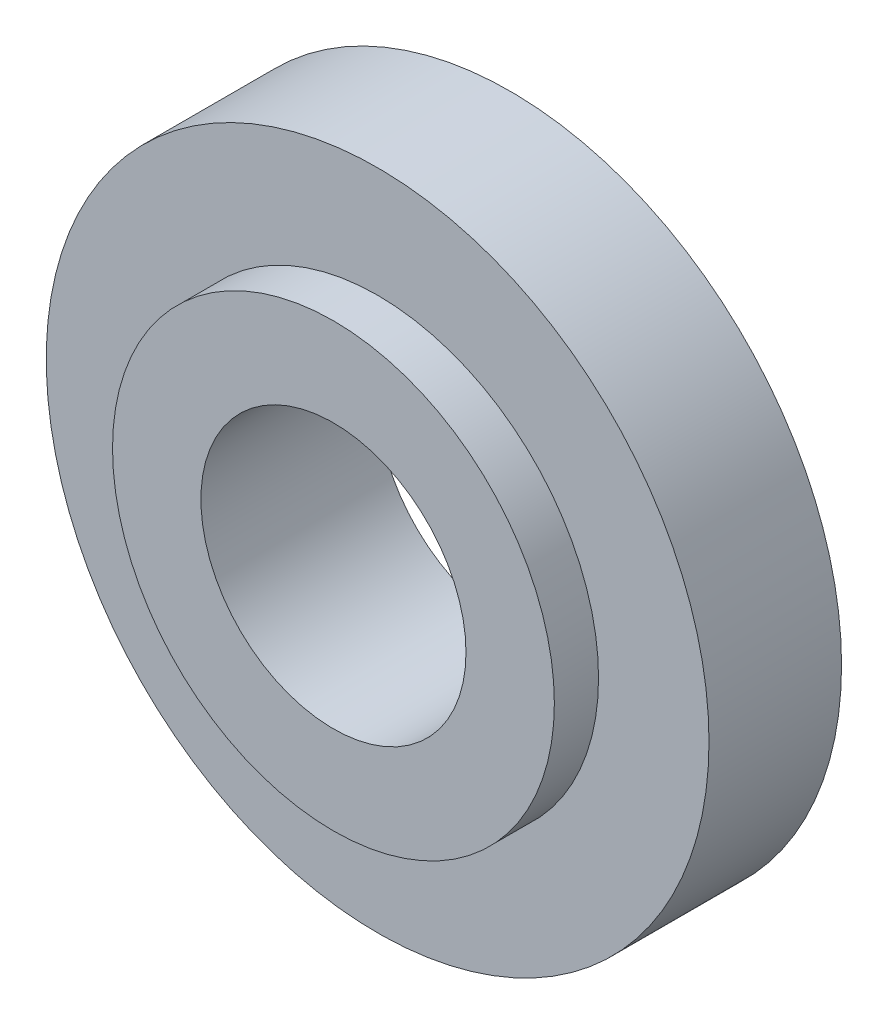
ISO-10303-21;
HEADER;
FILE_DESCRIPTION(('STEP AP214'),'2;1');
FILE_NAME('part.step','',(''),(''),'','','');
FILE_SCHEMA(('AUTOMOTIVE_DESIGN { 1 0 10303 214 1 1 1 1 }'));
ENDSEC;
DATA;
#1=APPLICATION_CONTEXT('core data for automotive mechanical design processes');
#2=APPLICATION_PROTOCOL_DEFINITION('international standard','automotive_design',2000,#1);
#3=PRODUCT_CONTEXT('',#1,'mechanical');
#4=PRODUCT('Part','Part','',(#3));
#5=PRODUCT_RELATED_PRODUCT_CATEGORY('part','',(#4));
#6=PRODUCT_DEFINITION_FORMATION('','',#4);
#7=PRODUCT_DEFINITION_CONTEXT('part definition',#1,'design');
#8=PRODUCT_DEFINITION('design','',#6,#7);
#9=PRODUCT_DEFINITION_SHAPE('','',#8);
#10=(LENGTH_UNIT() NAMED_UNIT(*) SI_UNIT(.MILLI.,.METRE.));
#11=(NAMED_UNIT(*) PLANE_ANGLE_UNIT() SI_UNIT($,.RADIAN.));
#12=(NAMED_UNIT(*) SI_UNIT($,.STERADIAN.) SOLID_ANGLE_UNIT());
#13=UNCERTAINTY_MEASURE_WITH_UNIT(LENGTH_MEASURE(1.E-05),#10,'distance_accuracy_value','');
#14=(GEOMETRIC_REPRESENTATION_CONTEXT(3) GLOBAL_UNCERTAINTY_ASSIGNED_CONTEXT((#13)) GLOBAL_UNIT_ASSIGNED_CONTEXT((#10,
#11,#12)) REPRESENTATION_CONTEXT('',''));
#15=CARTESIAN_POINT('',(0.,0.,0.));
#16=DIRECTION('',(0.,0.,1.));
#17=DIRECTION('',(1.,0.,0.));
#18=AXIS2_PLACEMENT_3D('',#15,#16,#17);
#19=CARTESIAN_POINT('',(0.,0.,1.5));
#20=DIRECTION('',(0.,0.,-1.));
#21=DIRECTION('',(-1.,0.,0.));
#22=AXIS2_PLACEMENT_3D('',#19,#20,#21);
#23=CYLINDRICAL_SURFACE('',#22,3.75);
#24=CARTESIAN_POINT('',(0.,0.,1.5));
#25=DIRECTION('',(0.,0.,1.));
#26=DIRECTION('',(1.,0.,0.));
#27=AXIS2_PLACEMENT_3D('',#24,#25,#26);
#28=CIRCLE('',#27,3.75);
#29=CARTESIAN_POINT('',(3.75,0.,1.5));
#30=VERTEX_POINT('',#29);
#31=EDGE_CURVE('E10',#30,#30,#28,.T.);
#32=ORIENTED_EDGE('',*,*,#31,.F.);
#33=EDGE_LOOP('',(#32));
#34=FACE_BOUND('',#33,.T.);
#35=CARTESIAN_POINT('',(0.,0.,0.));
#36=DIRECTION('',(0.,0.,1.));
#37=DIRECTION('',(1.,0.,0.));
#38=AXIS2_PLACEMENT_3D('',#35,#36,#37);
#39=CIRCLE('',#38,3.75);
#40=CARTESIAN_POINT('',(3.75,0.,0.));
#41=VERTEX_POINT('',#40);
#42=EDGE_CURVE('E37',#41,#41,#39,.T.);
#43=ORIENTED_EDGE('',*,*,#42,.T.);
#44=EDGE_LOOP('',(#43));
#45=FACE_BOUND('',#44,.T.);
#46=ADVANCED_FACE('F34',(#34,#45),#23,.T.);
#47=CARTESIAN_POINT('',(0.,0.,1.5));
#48=DIRECTION('',(0.,0.,1.));
#49=DIRECTION('',(1.,0.,0.));
#50=AXIS2_PLACEMENT_3D('',#47,#48,#49);
#51=PLANE('',#50);
#52=CARTESIAN_POINT('',(0.,0.,1.5));
#53=DIRECTION('',(0.,0.,1.));
#54=DIRECTION('',(1.,0.,0.));
#55=AXIS2_PLACEMENT_3D('',#52,#53,#54);
#56=CIRCLE('',#55,2.5);
#57=CARTESIAN_POINT('',(2.5,0.,1.5));
#58=VERTEX_POINT('',#57);
#59=EDGE_CURVE('E41',#58,#58,#56,.T.);
#60=ORIENTED_EDGE('',*,*,#59,.F.);
#61=EDGE_LOOP('',(#60));
#62=FACE_BOUND('',#61,.T.);
#63=ORIENTED_EDGE('',*,*,#31,.T.);
#64=EDGE_LOOP('',(#63));
#65=FACE_BOUND('',#64,.T.);
#66=ADVANCED_FACE('F76',(#62,#65),#51,.T.);
#67=CARTESIAN_POINT('',(0.,0.,0.));
#68=DIRECTION('',(0.,0.,1.));
#69=DIRECTION('',(1.,0.,0.));
#70=AXIS2_PLACEMENT_3D('',#67,#68,#69);
#71=PLANE('',#70);
#72=ORIENTED_EDGE('',*,*,#42,.F.);
#73=EDGE_LOOP('',(#72));
#74=FACE_BOUND('',#73,.T.);
#75=CARTESIAN_POINT('',(0.,0.,0.));
#76=DIRECTION('',(0.,0.,1.));
#77=DIRECTION('',(1.,0.,0.));
#78=AXIS2_PLACEMENT_3D('',#75,#76,#77);
#79=CIRCLE('',#78,1.5);
#80=CARTESIAN_POINT('',(1.5,0.,0.));
#81=VERTEX_POINT('',#80);
#82=EDGE_CURVE('E47',#81,#81,#79,.T.);
#83=ORIENTED_EDGE('',*,*,#82,.T.);
#84=EDGE_LOOP('',(#83));
#85=FACE_BOUND('',#84,.T.);
#86=ADVANCED_FACE('F73',(#74,#85),#71,.F.);
#87=CARTESIAN_POINT('',(0.,0.,2.));
#88=DIRECTION('',(0.,0.,-1.));
#89=DIRECTION('',(-1.,0.,0.));
#90=AXIS2_PLACEMENT_3D('',#87,#88,#89);
#91=CYLINDRICAL_SURFACE('',#90,1.5);
#92=CARTESIAN_POINT('',(0.,0.,2.));
#93=DIRECTION('',(0.,0.,1.));
#94=DIRECTION('',(1.,0.,0.));
#95=AXIS2_PLACEMENT_3D('',#92,#93,#94);
#96=CIRCLE('',#95,1.5);
#97=CARTESIAN_POINT('',(1.5,0.,2.));
#98=VERTEX_POINT('',#97);
#99=EDGE_CURVE('E50',#98,#98,#96,.T.);
#100=ORIENTED_EDGE('',*,*,#99,.T.);
#101=EDGE_LOOP('',(#100));
#102=FACE_BOUND('',#101,.T.);
#103=ORIENTED_EDGE('',*,*,#82,.F.);
#104=EDGE_LOOP('',(#103));
#105=FACE_BOUND('',#104,.T.);
#106=ADVANCED_FACE('F57',(#102,#105),#91,.F.);
#107=CARTESIAN_POINT('',(0.,0.,2.));
#108=DIRECTION('',(0.,0.,-1.));
#109=DIRECTION('',(-1.,0.,0.));
#110=AXIS2_PLACEMENT_3D('',#107,#108,#109);
#111=CYLINDRICAL_SURFACE('',#110,2.5);
#112=ORIENTED_EDGE('',*,*,#59,.T.);
#113=EDGE_LOOP('',(#112));
#114=FACE_BOUND('',#113,.T.);
#115=CARTESIAN_POINT('',(0.,0.,2.));
#116=DIRECTION('',(0.,0.,1.));
#117=DIRECTION('',(1.,0.,0.));
#118=AXIS2_PLACEMENT_3D('',#115,#116,#117);
#119=CIRCLE('',#118,2.5);
#120=CARTESIAN_POINT('',(2.5,0.,2.));
#121=VERTEX_POINT('',#120);
#122=EDGE_CURVE('E51',#121,#121,#119,.T.);
#123=ORIENTED_EDGE('',*,*,#122,.F.);
#124=EDGE_LOOP('',(#123));
#125=FACE_BOUND('',#124,.T.);
#126=ADVANCED_FACE('F63',(#114,#125),#111,.T.);
#127=CARTESIAN_POINT('',(0.,0.,2.));
#128=DIRECTION('',(0.,0.,1.));
#129=DIRECTION('',(1.,0.,0.));
#130=AXIS2_PLACEMENT_3D('',#127,#128,#129);
#131=PLANE('',#130);
#132=ORIENTED_EDGE('',*,*,#99,.F.);
#133=EDGE_LOOP('',(#132));
#134=FACE_BOUND('',#133,.T.);
#135=ORIENTED_EDGE('',*,*,#122,.T.);
#136=EDGE_LOOP('',(#135));
#137=FACE_BOUND('',#136,.T.);
#138=ADVANCED_FACE('F60',(#134,#137),#131,.T.);
#139=CLOSED_SHELL('',(#46,#66,#86,#106,#126,#138));
#140=MANIFOLD_SOLID_BREP('B2',#139);
#141=ADVANCED_BREP_SHAPE_REPRESENTATION('',(#18,#140),#14);
#142=SHAPE_DEFINITION_REPRESENTATION(#9,#141);
ENDSEC;
END-ISO-10303-21;
